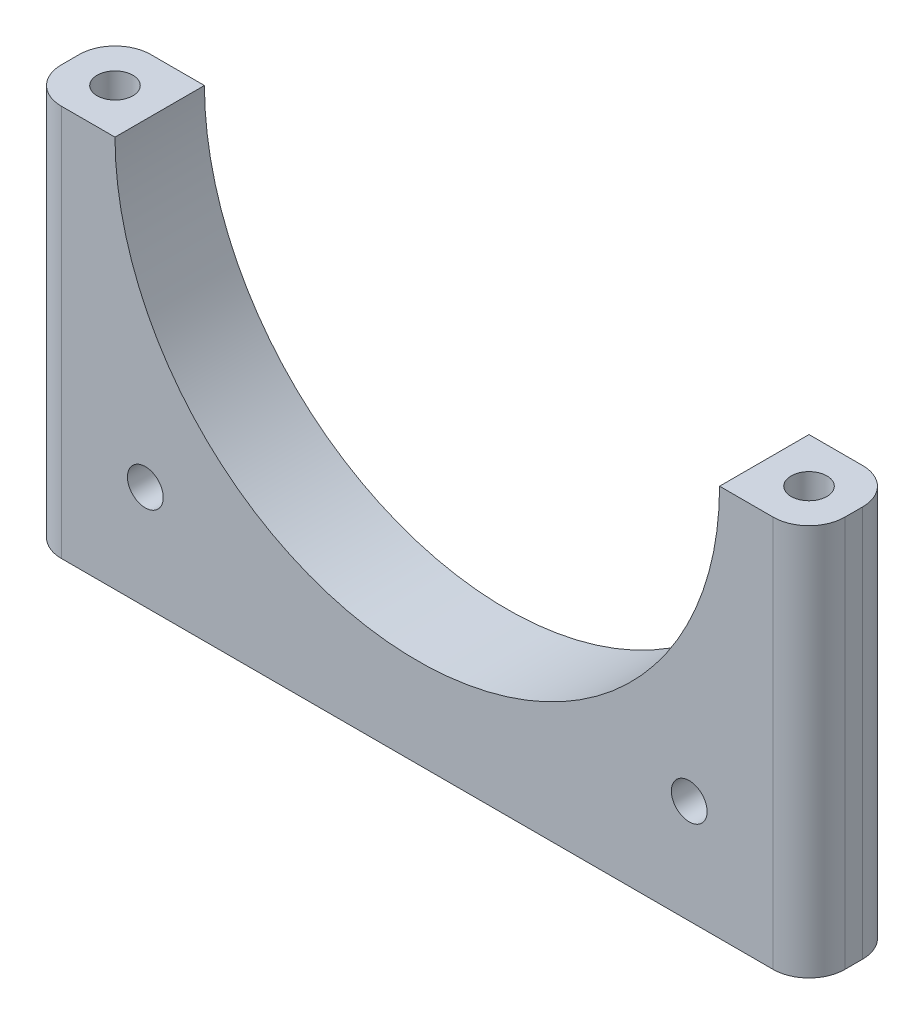
ISO-10303-21;
HEADER;
FILE_DESCRIPTION(('STEP AP214'),'2;1');
FILE_NAME('part.step','',(''),(''),'','','');
FILE_SCHEMA(('AUTOMOTIVE_DESIGN { 1 0 10303 214 1 1 1 1 }'));
ENDSEC;
DATA;
#1=APPLICATION_CONTEXT('core data for automotive mechanical design processes');
#2=APPLICATION_PROTOCOL_DEFINITION('international standard','automotive_design',2000,#1);
#3=PRODUCT_CONTEXT('',#1,'mechanical');
#4=PRODUCT('Part','Part','',(#3));
#5=PRODUCT_RELATED_PRODUCT_CATEGORY('part','',(#4));
#6=PRODUCT_DEFINITION_FORMATION('','',#4);
#7=PRODUCT_DEFINITION_CONTEXT('part definition',#1,'design');
#8=PRODUCT_DEFINITION('design','',#6,#7);
#9=PRODUCT_DEFINITION_SHAPE('','',#8);
#10=(LENGTH_UNIT() NAMED_UNIT(*) SI_UNIT(.MILLI.,.METRE.));
#11=(NAMED_UNIT(*) PLANE_ANGLE_UNIT() SI_UNIT($,.RADIAN.));
#12=(NAMED_UNIT(*) SI_UNIT($,.STERADIAN.) SOLID_ANGLE_UNIT());
#13=UNCERTAINTY_MEASURE_WITH_UNIT(LENGTH_MEASURE(1.E-05),#10,'distance_accuracy_value','');
#14=(GEOMETRIC_REPRESENTATION_CONTEXT(3) GLOBAL_UNCERTAINTY_ASSIGNED_CONTEXT((#13)) GLOBAL_UNIT_ASSIGNED_CONTEXT((#10,
#11,#12)) REPRESENTATION_CONTEXT('',''));
#15=CARTESIAN_POINT('',(0.,0.,0.));
#16=DIRECTION('',(0.,0.,1.));
#17=DIRECTION('',(1.,0.,0.));
#18=AXIS2_PLACEMENT_3D('',#15,#16,#17);
#19=CARTESIAN_POINT('',(0.,0.,25.));
#20=DIRECTION('',(0.,0.,1.));
#21=DIRECTION('',(1.,0.,0.));
#22=AXIS2_PLACEMENT_3D('',#19,#20,#21);
#23=PLANE('',#22);
#24=CARTESIAN_POINT('',(76.015,3.99,25.));
#25=DIRECTION('',(0.,0.,1.));
#26=DIRECTION('',(1.,0.,0.));
#27=AXIS2_PLACEMENT_3D('',#24,#25,#26);
#28=CIRCLE('',#27,5.);
#29=CARTESIAN_POINT('',(81.015,3.99,25.));
#30=VERTEX_POINT('',#29);
#31=EDGE_CURVE('E277',#30,#30,#28,.F.);
#32=ORIENTED_EDGE('',*,*,#31,.T.);
#33=EDGE_LOOP('',(#32));
#34=FACE_BOUND('',#33,.T.);
#35=DIRECTION('',(-1.,0.,0.));
#36=VECTOR('',#35,1.);
#37=CARTESIAN_POINT('',(0.,-25.,25.));
#38=LINE('',#37,#36);
#39=CARTESIAN_POINT('',(99.5,-25.,25.));
#40=VERTEX_POINT('',#39);
#41=CARTESIAN_POINT('',(-99.5,-25.,25.));
#42=VERTEX_POINT('',#41);
#43=EDGE_CURVE('E149',#40,#42,#38,.T.);
#44=ORIENTED_EDGE('',*,*,#43,.F.);
#45=DIRECTION('',(0.,-1.,0.));
#46=VECTOR('',#45,1.);
#47=CARTESIAN_POINT('',(99.5,0.,25.));
#48=LINE('',#47,#46);
#49=CARTESIAN_POINT('',(99.5,84.5,25.));
#50=VERTEX_POINT('',#49);
#51=EDGE_CURVE('E147',#40,#50,#48,.F.);
#52=ORIENTED_EDGE('',*,*,#51,.T.);
#53=DIRECTION('',(1.,0.,0.));
#54=VECTOR('',#53,1.);
#55=CARTESIAN_POINT('',(0.,84.5,25.));
#56=LINE('',#55,#54);
#57=CARTESIAN_POINT('',(84.5,84.5,25.));
#58=VERTEX_POINT('',#57);
#59=EDGE_CURVE('E128',#58,#50,#56,.T.);
#60=ORIENTED_EDGE('',*,*,#59,.F.);
#61=CARTESIAN_POINT('',(0.,84.5,25.));
#62=DIRECTION('',(0.,0.,1.));
#63=DIRECTION('',(1.,0.,0.));
#64=AXIS2_PLACEMENT_3D('',#61,#62,#63);
#65=CIRCLE('',#64,84.5);
#66=CARTESIAN_POINT('',(-84.5,84.5,25.));
#67=VERTEX_POINT('',#66);
#68=EDGE_CURVE('E145',#67,#58,#65,.T.);
#69=ORIENTED_EDGE('',*,*,#68,.F.);
#70=CARTESIAN_POINT('',(-99.5,84.5,25.));
#71=VERTEX_POINT('',#70);
#72=EDGE_CURVE('E151',#71,#67,#56,.T.);
#73=ORIENTED_EDGE('',*,*,#72,.F.);
#74=DIRECTION('',(0.,-1.,0.));
#75=VECTOR('',#74,1.);
#76=CARTESIAN_POINT('',(-99.5,-25.,25.));
#77=LINE('',#76,#75);
#78=EDGE_CURVE('E216',#71,#42,#77,.T.);
#79=ORIENTED_EDGE('',*,*,#78,.T.);
#80=EDGE_LOOP('',(#44,#52,#60,#69,#73,#79));
#81=FACE_BOUND('',#80,.T.);
#82=CARTESIAN_POINT('',(-76.015,3.98999999999999,25.));
#83=DIRECTION('',(0.,0.,1.));
#84=DIRECTION('',(1.,0.,0.));
#85=AXIS2_PLACEMENT_3D('',#82,#83,#84);
#86=CIRCLE('',#85,5.);
#87=CARTESIAN_POINT('',(-71.015,3.98999999999999,25.));
#88=VERTEX_POINT('',#87);
#89=EDGE_CURVE('E193',#88,#88,#86,.T.);
#90=ORIENTED_EDGE('',*,*,#89,.F.);
#91=EDGE_LOOP('',(#90));
#92=FACE_BOUND('',#91,.T.);
#93=ADVANCED_FACE('F47',(#34,#81,#92),#23,.T.);
#94=CARTESIAN_POINT('',(0.,0.,0.));
#95=DIRECTION('',(0.,0.,1.));
#96=DIRECTION('',(1.,0.,0.));
#97=AXIS2_PLACEMENT_3D('',#94,#95,#96);
#98=PLANE('',#97);
#99=DIRECTION('',(1.,0.,0.));
#100=VECTOR('',#99,1.);
#101=CARTESIAN_POINT('',(0.,84.5,0.));
#102=LINE('',#101,#100);
#103=CARTESIAN_POINT('',(84.5,84.5,0.));
#104=VERTEX_POINT('',#103);
#105=CARTESIAN_POINT('',(99.5,84.5,0.));
#106=VERTEX_POINT('',#105);
#107=EDGE_CURVE('E131',#104,#106,#102,.T.);
#108=ORIENTED_EDGE('',*,*,#107,.T.);
#109=DIRECTION('',(0.,-1.,0.));
#110=VECTOR('',#109,1.);
#111=CARTESIAN_POINT('',(99.5,-25.,0.));
#112=LINE('',#111,#110);
#113=CARTESIAN_POINT('',(99.5,-25.,0.));
#114=VERTEX_POINT('',#113);
#115=EDGE_CURVE('E231',#106,#114,#112,.T.);
#116=ORIENTED_EDGE('',*,*,#115,.T.);
#117=DIRECTION('',(-1.,0.,0.));
#118=VECTOR('',#117,1.);
#119=CARTESIAN_POINT('',(0.,-25.,0.));
#120=LINE('',#119,#118);
#121=CARTESIAN_POINT('',(-99.5,-25.,0.));
#122=VERTEX_POINT('',#121);
#123=EDGE_CURVE('E161',#114,#122,#120,.T.);
#124=ORIENTED_EDGE('',*,*,#123,.T.);
#125=DIRECTION('',(0.,-1.,0.));
#126=VECTOR('',#125,1.);
#127=CARTESIAN_POINT('',(-99.5,0.,0.));
#128=LINE('',#127,#126);
#129=CARTESIAN_POINT('',(-99.5,84.5,0.));
#130=VERTEX_POINT('',#129);
#131=EDGE_CURVE('E228',#122,#130,#128,.F.);
#132=ORIENTED_EDGE('',*,*,#131,.T.);
#133=CARTESIAN_POINT('',(-84.5,84.5,0.));
#134=VERTEX_POINT('',#133);
#135=EDGE_CURVE('E169',#130,#134,#102,.T.);
#136=ORIENTED_EDGE('',*,*,#135,.T.);
#137=CARTESIAN_POINT('',(0.,84.5,0.));
#138=DIRECTION('',(0.,0.,1.));
#139=DIRECTION('',(1.,0.,0.));
#140=AXIS2_PLACEMENT_3D('',#137,#138,#139);
#141=CIRCLE('',#140,84.5);
#142=EDGE_CURVE('E168',#134,#104,#141,.T.);
#143=ORIENTED_EDGE('',*,*,#142,.T.);
#144=EDGE_LOOP('',(#108,#116,#124,#132,#136,#143));
#145=FACE_BOUND('',#144,.T.);
#146=CARTESIAN_POINT('',(76.015,3.99,0.));
#147=DIRECTION('',(0.,0.,1.));
#148=DIRECTION('',(1.,0.,0.));
#149=AXIS2_PLACEMENT_3D('',#146,#147,#148);
#150=CIRCLE('',#149,5.);
#151=CARTESIAN_POINT('',(81.015,3.99,0.));
#152=VERTEX_POINT('',#151);
#153=EDGE_CURVE('E188',#152,#152,#150,.F.);
#154=ORIENTED_EDGE('',*,*,#153,.F.);
#155=EDGE_LOOP('',(#154));
#156=FACE_BOUND('',#155,.T.);
#157=CARTESIAN_POINT('',(-76.015,3.98999999999999,0.));
#158=DIRECTION('',(0.,0.,1.));
#159=DIRECTION('',(1.,0.,0.));
#160=AXIS2_PLACEMENT_3D('',#157,#158,#159);
#161=CIRCLE('',#160,5.);
#162=CARTESIAN_POINT('',(-71.015,3.98999999999999,0.));
#163=VERTEX_POINT('',#162);
#164=EDGE_CURVE('E192',#163,#163,#161,.T.);
#165=ORIENTED_EDGE('',*,*,#164,.T.);
#166=EDGE_LOOP('',(#165));
#167=FACE_BOUND('',#166,.T.);
#168=ADVANCED_FACE('F256',(#145,#156,#167),#98,.F.);
#169=CARTESIAN_POINT('',(0.,-25.,25.));
#170=DIRECTION('',(0.,-1.,0.));
#171=DIRECTION('',(0.,0.,-1.));
#172=AXIS2_PLACEMENT_3D('',#169,#170,#171);
#173=PLANE('',#172);
#174=CARTESIAN_POINT('',(97.,-25.0000000000004,12.5));
#175=DIRECTION('',(0.,-1.,0.));
#176=DIRECTION('',(0.,0.,-1.));
#177=AXIS2_PLACEMENT_3D('',#174,#175,#176);
#178=CIRCLE('',#177,5.);
#179=CARTESIAN_POINT('',(97.,-25.0000000000004,7.49999999999997));
#180=VERTEX_POINT('',#179);
#181=EDGE_CURVE('E165',#180,#180,#178,.F.);
#182=ORIENTED_EDGE('',*,*,#181,.T.);
#183=EDGE_LOOP('',(#182));
#184=FACE_BOUND('',#183,.T.);
#185=DIRECTION('',(0.,0.,-1.));
#186=VECTOR('',#185,1.);
#187=CARTESIAN_POINT('',(109.5,-25.,25.));
#188=LINE('',#187,#186);
#189=CARTESIAN_POINT('',(109.5,-25.,15.));
#190=VERTEX_POINT('',#189);
#191=CARTESIAN_POINT('',(109.5,-25.,10.));
#192=VERTEX_POINT('',#191);
#193=EDGE_CURVE('E183',#190,#192,#188,.T.);
#194=ORIENTED_EDGE('',*,*,#193,.F.);
#195=CARTESIAN_POINT('',(99.5,-25.,15.));
#196=DIRECTION('',(0.,-1.,0.));
#197=DIRECTION('',(0.,0.,-1.));
#198=AXIS2_PLACEMENT_3D('',#195,#196,#197);
#199=CIRCLE('',#198,10.);
#200=EDGE_CURVE('E213',#190,#40,#199,.T.);
#201=ORIENTED_EDGE('',*,*,#200,.T.);
#202=ORIENTED_EDGE('',*,*,#43,.T.);
#203=CARTESIAN_POINT('',(-99.5,-25.,15.));
#204=DIRECTION('',(0.,-1.,0.));
#205=DIRECTION('',(0.,0.,-1.));
#206=AXIS2_PLACEMENT_3D('',#203,#204,#205);
#207=CIRCLE('',#206,10.);
#208=CARTESIAN_POINT('',(-109.5,-25.,15.));
#209=VERTEX_POINT('',#208);
#210=EDGE_CURVE('E207',#42,#209,#207,.T.);
#211=ORIENTED_EDGE('',*,*,#210,.T.);
#212=DIRECTION('',(0.,0.,-1.));
#213=VECTOR('',#212,1.);
#214=CARTESIAN_POINT('',(-109.5,-25.,25.));
#215=LINE('',#214,#213);
#216=CARTESIAN_POINT('',(-109.5,-25.,10.));
#217=VERTEX_POINT('',#216);
#218=EDGE_CURVE('E158',#209,#217,#215,.T.);
#219=ORIENTED_EDGE('',*,*,#218,.T.);
#220=CARTESIAN_POINT('',(-99.5,-25.,10.));
#221=DIRECTION('',(0.,-1.,0.));
#222=DIRECTION('',(0.,0.,-1.));
#223=AXIS2_PLACEMENT_3D('',#220,#221,#222);
#224=CIRCLE('',#223,10.);
#225=EDGE_CURVE('E204',#217,#122,#224,.T.);
#226=ORIENTED_EDGE('',*,*,#225,.T.);
#227=ORIENTED_EDGE('',*,*,#123,.F.);
#228=CARTESIAN_POINT('',(99.5,-25.,10.));
#229=DIRECTION('',(0.,-1.,0.));
#230=DIRECTION('',(0.,0.,-1.));
#231=AXIS2_PLACEMENT_3D('',#228,#229,#230);
#232=CIRCLE('',#231,10.);
#233=EDGE_CURVE('E210',#114,#192,#232,.T.);
#234=ORIENTED_EDGE('',*,*,#233,.T.);
#235=EDGE_LOOP('',(#194,#201,#202,#211,#219,#226,#227,#234));
#236=FACE_BOUND('',#235,.T.);
#237=CARTESIAN_POINT('',(-97.,-25.0000000000004,12.5));
#238=DIRECTION('',(0.,-1.,0.));
#239=DIRECTION('',(0.,0.,-1.));
#240=AXIS2_PLACEMENT_3D('',#237,#238,#239);
#241=CIRCLE('',#240,5.);
#242=CARTESIAN_POINT('',(-97.,-25.0000000000004,7.5));
#243=VERTEX_POINT('',#242);
#244=EDGE_CURVE('E266',#243,#243,#241,.T.);
#245=ORIENTED_EDGE('',*,*,#244,.F.);
#246=EDGE_LOOP('',(#245));
#247=FACE_BOUND('',#246,.T.);
#248=ADVANCED_FACE('F246',(#184,#236,#247),#173,.T.);
#249=CARTESIAN_POINT('',(109.5,0.,25.));
#250=DIRECTION('',(1.,0.,0.));
#251=DIRECTION('',(0.,1.,0.));
#252=AXIS2_PLACEMENT_3D('',#249,#250,#251);
#253=PLANE('',#252);
#254=DIRECTION('',(0.,0.,-1.));
#255=VECTOR('',#254,1.);
#256=CARTESIAN_POINT('',(109.5,84.5,25.));
#257=LINE('',#256,#255);
#258=CARTESIAN_POINT('',(109.5,84.5,15.));
#259=VERTEX_POINT('',#258);
#260=CARTESIAN_POINT('',(109.5,84.5,10.));
#261=VERTEX_POINT('',#260);
#262=EDGE_CURVE('E137',#259,#261,#257,.T.);
#263=ORIENTED_EDGE('',*,*,#262,.F.);
#264=DIRECTION('',(0.,-1.,0.));
#265=VECTOR('',#264,1.);
#266=CARTESIAN_POINT('',(109.5,0.,15.));
#267=LINE('',#266,#265);
#268=EDGE_CURVE('E200',#259,#190,#267,.T.);
#269=ORIENTED_EDGE('',*,*,#268,.T.);
#270=ORIENTED_EDGE('',*,*,#193,.T.);
#271=DIRECTION('',(0.,-1.,0.));
#272=VECTOR('',#271,1.);
#273=CARTESIAN_POINT('',(109.5,84.5,10.));
#274=LINE('',#273,#272);
#275=EDGE_CURVE('E187',#192,#261,#274,.F.);
#276=ORIENTED_EDGE('',*,*,#275,.T.);
#277=EDGE_LOOP('',(#263,#269,#270,#276));
#278=FACE_BOUND('',#277,.T.);
#279=ADVANCED_FACE('F307',(#278),#253,.T.);
#280=CARTESIAN_POINT('',(0.,84.5,25.));
#281=DIRECTION('',(0.,1.,0.));
#282=DIRECTION('',(0.,0.,1.));
#283=AXIS2_PLACEMENT_3D('',#280,#281,#282);
#284=PLANE('',#283);
#285=CARTESIAN_POINT('',(97.,84.5,12.5));
#286=DIRECTION('',(0.,-1.,0.));
#287=DIRECTION('',(0.,0.,-1.));
#288=AXIS2_PLACEMENT_3D('',#285,#286,#287);
#289=CIRCLE('',#288,5.);
#290=CARTESIAN_POINT('',(97.,84.5,7.49999999999997));
#291=VERTEX_POINT('',#290);
#292=EDGE_CURVE('E197',#291,#291,#289,.T.);
#293=ORIENTED_EDGE('',*,*,#292,.T.);
#294=EDGE_LOOP('',(#293));
#295=FACE_BOUND('',#294,.T.);
#296=ORIENTED_EDGE('',*,*,#59,.T.);
#297=CARTESIAN_POINT('',(99.5,84.5,15.));
#298=DIRECTION('',(0.,1.,0.));
#299=DIRECTION('',(0.,0.,1.));
#300=AXIS2_PLACEMENT_3D('',#297,#298,#299);
#301=CIRCLE('',#300,10.);
#302=EDGE_CURVE('E225',#50,#259,#301,.T.);
#303=ORIENTED_EDGE('',*,*,#302,.T.);
#304=ORIENTED_EDGE('',*,*,#262,.T.);
#305=CARTESIAN_POINT('',(99.5,84.5,10.));
#306=DIRECTION('',(0.,1.,0.));
#307=DIRECTION('',(0.,0.,1.));
#308=AXIS2_PLACEMENT_3D('',#305,#306,#307);
#309=CIRCLE('',#308,10.);
#310=EDGE_CURVE('E222',#261,#106,#309,.T.);
#311=ORIENTED_EDGE('',*,*,#310,.T.);
#312=ORIENTED_EDGE('',*,*,#107,.F.);
#313=DIRECTION('',(0.,0.,-1.));
#314=VECTOR('',#313,1.);
#315=CARTESIAN_POINT('',(84.5,84.5,25.));
#316=LINE('',#315,#314);
#317=EDGE_CURVE('E125',#58,#104,#316,.T.);
#318=ORIENTED_EDGE('',*,*,#317,.F.);
#319=EDGE_LOOP('',(#296,#303,#304,#311,#312,#318));
#320=FACE_BOUND('',#319,.T.);
#321=ADVANCED_FACE('F127',(#295,#320),#284,.T.);
#322=CARTESIAN_POINT('',(0.,84.5,25.));
#323=DIRECTION('',(0.,0.,-1.));
#324=DIRECTION('',(-1.,0.,0.));
#325=AXIS2_PLACEMENT_3D('',#322,#323,#324);
#326=CYLINDRICAL_SURFACE('',#325,84.5);
#327=ORIENTED_EDGE('',*,*,#142,.F.);
#328=DIRECTION('',(0.,0.,-1.));
#329=VECTOR('',#328,1.);
#330=CARTESIAN_POINT('',(-84.5,84.5,25.));
#331=LINE('',#330,#329);
#332=EDGE_CURVE('E138',#67,#134,#331,.T.);
#333=ORIENTED_EDGE('',*,*,#332,.F.);
#334=ORIENTED_EDGE('',*,*,#68,.T.);
#335=ORIENTED_EDGE('',*,*,#317,.T.);
#336=EDGE_LOOP('',(#327,#333,#334,#335));
#337=FACE_BOUND('',#336,.T.);
#338=ADVANCED_FACE('F153',(#337),#326,.F.);
#339=CARTESIAN_POINT('',(-97.,84.5,12.5));
#340=DIRECTION('',(0.,1.,0.));
#341=DIRECTION('',(0.,0.,1.));
#342=AXIS2_PLACEMENT_3D('',#339,#340,#341);
#343=CIRCLE('',#342,5.);
#344=CARTESIAN_POINT('',(-97.,84.5,17.5));
#345=VERTEX_POINT('',#344);
#346=EDGE_CURVE('E270',#345,#345,#343,.T.);
#347=ORIENTED_EDGE('',*,*,#346,.F.);
#348=EDGE_LOOP('',(#347));
#349=FACE_BOUND('',#348,.T.);
#350=DIRECTION('',(0.,0.,-1.));
#351=VECTOR('',#350,1.);
#352=CARTESIAN_POINT('',(-109.5,84.5,25.));
#353=LINE('',#352,#351);
#354=CARTESIAN_POINT('',(-109.5,84.5,15.));
#355=VERTEX_POINT('',#354);
#356=CARTESIAN_POINT('',(-109.5,84.5,10.));
#357=VERTEX_POINT('',#356);
#358=EDGE_CURVE('E175',#355,#357,#353,.T.);
#359=ORIENTED_EDGE('',*,*,#358,.F.);
#360=CARTESIAN_POINT('',(-99.5,84.5,15.));
#361=DIRECTION('',(0.,1.,0.));
#362=DIRECTION('',(0.,0.,1.));
#363=AXIS2_PLACEMENT_3D('',#360,#361,#362);
#364=CIRCLE('',#363,10.);
#365=EDGE_CURVE('E11',#355,#71,#364,.T.);
#366=ORIENTED_EDGE('',*,*,#365,.T.);
#367=ORIENTED_EDGE('',*,*,#72,.T.);
#368=ORIENTED_EDGE('',*,*,#332,.T.);
#369=ORIENTED_EDGE('',*,*,#135,.F.);
#370=CARTESIAN_POINT('',(-99.5,84.5,10.));
#371=DIRECTION('',(0.,1.,0.));
#372=DIRECTION('',(0.,0.,1.));
#373=AXIS2_PLACEMENT_3D('',#370,#371,#372);
#374=CIRCLE('',#373,10.);
#375=EDGE_CURVE('E56',#130,#357,#374,.T.);
#376=ORIENTED_EDGE('',*,*,#375,.T.);
#377=EDGE_LOOP('',(#359,#366,#367,#368,#369,#376));
#378=FACE_BOUND('',#377,.T.);
#379=ADVANCED_FACE('F254',(#349,#378),#284,.T.);
#380=CARTESIAN_POINT('',(-109.5,0.,25.));
#381=DIRECTION('',(1.,0.,0.));
#382=DIRECTION('',(0.,1.,0.));
#383=AXIS2_PLACEMENT_3D('',#380,#381,#382);
#384=PLANE('',#383);
#385=ORIENTED_EDGE('',*,*,#218,.F.);
#386=DIRECTION('',(0.,-1.,0.));
#387=VECTOR('',#386,1.);
#388=CARTESIAN_POINT('',(-109.5,84.5,15.));
#389=LINE('',#388,#387);
#390=EDGE_CURVE('E69',#209,#355,#389,.F.);
#391=ORIENTED_EDGE('',*,*,#390,.T.);
#392=ORIENTED_EDGE('',*,*,#358,.T.);
#393=DIRECTION('',(0.,-1.,0.));
#394=VECTOR('',#393,1.);
#395=CARTESIAN_POINT('',(-109.5,0.,10.));
#396=LINE('',#395,#394);
#397=EDGE_CURVE('E235',#357,#217,#396,.T.);
#398=ORIENTED_EDGE('',*,*,#397,.T.);
#399=EDGE_LOOP('',(#385,#391,#392,#398));
#400=FACE_BOUND('',#399,.T.);
#401=ADVANCED_FACE('F242',(#400),#384,.F.);
#402=CARTESIAN_POINT('',(-97.,-4915.5,12.5));
#403=DIRECTION('',(0.,1.,0.));
#404=DIRECTION('',(0.,0.,1.));
#405=AXIS2_PLACEMENT_3D('',#402,#403,#404);
#406=CYLINDRICAL_SURFACE('',#405,5.);
#407=ORIENTED_EDGE('',*,*,#244,.T.);
#408=EDGE_LOOP('',(#407));
#409=FACE_BOUND('',#408,.T.);
#410=ORIENTED_EDGE('',*,*,#346,.T.);
#411=EDGE_LOOP('',(#410));
#412=FACE_BOUND('',#411,.T.);
#413=ADVANCED_FACE('F301',(#409,#412),#406,.F.);
#414=CARTESIAN_POINT('',(97.,-4915.5,12.5));
#415=DIRECTION('',(0.,1.,0.));
#416=DIRECTION('',(0.,0.,1.));
#417=AXIS2_PLACEMENT_3D('',#414,#415,#416);
#418=CYLINDRICAL_SURFACE('',#417,5.);
#419=ORIENTED_EDGE('',*,*,#181,.F.);
#420=EDGE_LOOP('',(#419));
#421=FACE_BOUND('',#420,.T.);
#422=ORIENTED_EDGE('',*,*,#292,.F.);
#423=EDGE_LOOP('',(#422));
#424=FACE_BOUND('',#423,.T.);
#425=ADVANCED_FACE('F296',(#421,#424),#418,.F.);
#426=CARTESIAN_POINT('',(76.015,3.99,-4975.));
#427=DIRECTION('',(0.,0.,1.));
#428=DIRECTION('',(1.,0.,0.));
#429=AXIS2_PLACEMENT_3D('',#426,#427,#428);
#430=CYLINDRICAL_SURFACE('',#429,5.);
#431=ORIENTED_EDGE('',*,*,#31,.F.);
#432=EDGE_LOOP('',(#431));
#433=FACE_BOUND('',#432,.T.);
#434=ORIENTED_EDGE('',*,*,#153,.T.);
#435=EDGE_LOOP('',(#434));
#436=FACE_BOUND('',#435,.T.);
#437=ADVANCED_FACE('F352',(#433,#436),#430,.F.);
#438=CARTESIAN_POINT('',(-76.015,3.98999999999999,-4975.));
#439=DIRECTION('',(0.,0.,1.));
#440=DIRECTION('',(1.,0.,0.));
#441=AXIS2_PLACEMENT_3D('',#438,#439,#440);
#442=CYLINDRICAL_SURFACE('',#441,5.);
#443=ORIENTED_EDGE('',*,*,#89,.T.);
#444=EDGE_LOOP('',(#443));
#445=FACE_BOUND('',#444,.T.);
#446=ORIENTED_EDGE('',*,*,#164,.F.);
#447=EDGE_LOOP('',(#446));
#448=FACE_BOUND('',#447,.T.);
#449=ADVANCED_FACE('F285',(#445,#448),#442,.F.);
#450=CARTESIAN_POINT('',(99.5,0.,15.));
#451=DIRECTION('',(0.,-1.,0.));
#452=DIRECTION('',(1.,0.,0.));
#453=AXIS2_PLACEMENT_3D('',#450,#451,#452);
#454=CYLINDRICAL_SURFACE('',#453,10.);
#455=ORIENTED_EDGE('',*,*,#302,.F.);
#456=ORIENTED_EDGE('',*,*,#51,.F.);
#457=ORIENTED_EDGE('',*,*,#200,.F.);
#458=ORIENTED_EDGE('',*,*,#268,.F.);
#459=EDGE_LOOP('',(#455,#456,#457,#458));
#460=FACE_BOUND('',#459,.T.);
#461=ADVANCED_FACE('F314',(#460),#454,.T.);
#462=CARTESIAN_POINT('',(99.5,0.,10.));
#463=DIRECTION('',(0.,1.,0.));
#464=DIRECTION('',(-1.,0.,0.));
#465=AXIS2_PLACEMENT_3D('',#462,#463,#464);
#466=CYLINDRICAL_SURFACE('',#465,10.);
#467=ORIENTED_EDGE('',*,*,#310,.F.);
#468=ORIENTED_EDGE('',*,*,#275,.F.);
#469=ORIENTED_EDGE('',*,*,#233,.F.);
#470=ORIENTED_EDGE('',*,*,#115,.F.);
#471=EDGE_LOOP('',(#467,#468,#469,#470));
#472=FACE_BOUND('',#471,.T.);
#473=ADVANCED_FACE('F317',(#472),#466,.T.);
#474=CARTESIAN_POINT('',(-99.5,0.,15.));
#475=DIRECTION('',(0.,1.,0.));
#476=DIRECTION('',(-1.,0.,0.));
#477=AXIS2_PLACEMENT_3D('',#474,#475,#476);
#478=CYLINDRICAL_SURFACE('',#477,10.);
#479=ORIENTED_EDGE('',*,*,#365,.F.);
#480=ORIENTED_EDGE('',*,*,#390,.F.);
#481=ORIENTED_EDGE('',*,*,#210,.F.);
#482=ORIENTED_EDGE('',*,*,#78,.F.);
#483=EDGE_LOOP('',(#479,#480,#481,#482));
#484=FACE_BOUND('',#483,.T.);
#485=ADVANCED_FACE('F253',(#484),#478,.T.);
#486=CARTESIAN_POINT('',(-99.5,0.,10.));
#487=DIRECTION('',(0.,-1.,0.));
#488=DIRECTION('',(1.,0.,0.));
#489=AXIS2_PLACEMENT_3D('',#486,#487,#488);
#490=CYLINDRICAL_SURFACE('',#489,10.);
#491=ORIENTED_EDGE('',*,*,#375,.F.);
#492=ORIENTED_EDGE('',*,*,#131,.F.);
#493=ORIENTED_EDGE('',*,*,#225,.F.);
#494=ORIENTED_EDGE('',*,*,#397,.F.);
#495=EDGE_LOOP('',(#491,#492,#493,#494));
#496=FACE_BOUND('',#495,.T.);
#497=ADVANCED_FACE('F49',(#496),#490,.T.);
#498=CLOSED_SHELL('',(#93,#168,#248,#279,#321,#338,#379,#401,#413,#425,#437,#449,#461,#473,#485,#497));
#499=MANIFOLD_SOLID_BREP('B2',#498);
#500=ADVANCED_BREP_SHAPE_REPRESENTATION('',(#18,#499),#14);
#501=SHAPE_DEFINITION_REPRESENTATION(#9,#500);
ENDSEC;
END-ISO-10303-21;
